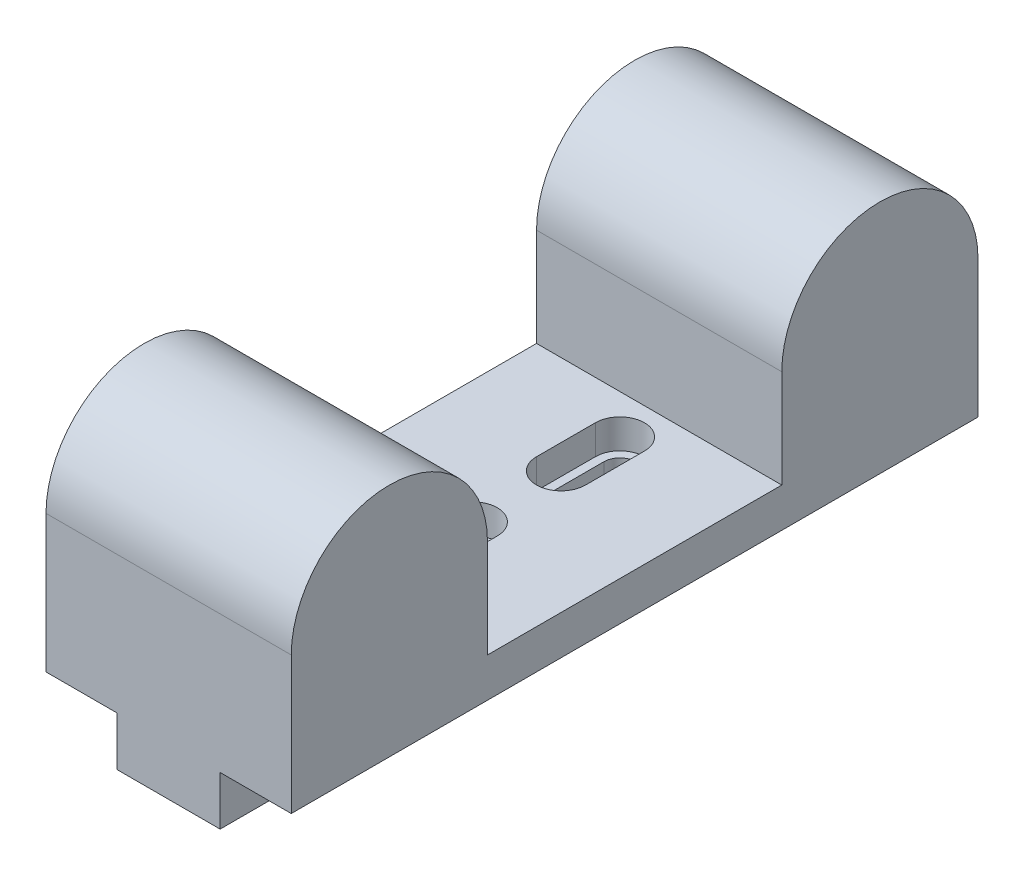
ISO-10303-21;
HEADER;
FILE_DESCRIPTION(('STEP AP214'),'2;1');
FILE_NAME('part.step','',(''),(''),'','','');
FILE_SCHEMA(('AUTOMOTIVE_DESIGN { 1 0 10303 214 1 1 1 1 }'));
ENDSEC;
DATA;
#1=APPLICATION_CONTEXT('core data for automotive mechanical design processes');
#2=APPLICATION_PROTOCOL_DEFINITION('international standard','automotive_design',2000,#1);
#3=PRODUCT_CONTEXT('',#1,'mechanical');
#4=PRODUCT('Part','Part','',(#3));
#5=PRODUCT_RELATED_PRODUCT_CATEGORY('part','',(#4));
#6=PRODUCT_DEFINITION_FORMATION('','',#4);
#7=PRODUCT_DEFINITION_CONTEXT('part definition',#1,'design');
#8=PRODUCT_DEFINITION('design','',#6,#7);
#9=PRODUCT_DEFINITION_SHAPE('','',#8);
#10=(LENGTH_UNIT() NAMED_UNIT(*) SI_UNIT(.MILLI.,.METRE.));
#11=(NAMED_UNIT(*) PLANE_ANGLE_UNIT() SI_UNIT($,.RADIAN.));
#12=(NAMED_UNIT(*) SI_UNIT($,.STERADIAN.) SOLID_ANGLE_UNIT());
#13=UNCERTAINTY_MEASURE_WITH_UNIT(LENGTH_MEASURE(1.E-05),#10,'distance_accuracy_value','');
#14=(GEOMETRIC_REPRESENTATION_CONTEXT(3) GLOBAL_UNCERTAINTY_ASSIGNED_CONTEXT((#13)) GLOBAL_UNIT_ASSIGNED_CONTEXT((#10,
#11,#12)) REPRESENTATION_CONTEXT('',''));
#15=CARTESIAN_POINT('',(0.,0.,0.));
#16=DIRECTION('',(0.,0.,1.));
#17=DIRECTION('',(1.,0.,0.));
#18=AXIS2_PLACEMENT_3D('',#15,#16,#17);
#19=CARTESIAN_POINT('',(0.,-5.,-46.));
#20=DIRECTION('',(0.,1.,0.));
#21=DIRECTION('',(0.,0.,1.));
#22=AXIS2_PLACEMENT_3D('',#19,#20,#21);
#23=CYLINDRICAL_SURFACE('',#22,1.625);
#24=CARTESIAN_POINT('',(0.,1.,-46.));
#25=DIRECTION('',(0.,1.,0.));
#26=DIRECTION('',(0.,0.,1.));
#27=AXIS2_PLACEMENT_3D('',#24,#25,#26);
#28=CIRCLE('',#27,1.625);
#29=CARTESIAN_POINT('',(1.625,1.,-46.));
#30=VERTEX_POINT('',#29);
#31=CARTESIAN_POINT('',(-1.62500000000001,1.,-46.));
#32=VERTEX_POINT('',#31);
#33=EDGE_CURVE('E598',#30,#32,#28,.T.);
#34=ORIENTED_EDGE('',*,*,#33,.T.);
#35=DIRECTION('',(0.,1.,0.));
#36=VECTOR('',#35,1.);
#37=CARTESIAN_POINT('',(-1.625,-5.,-46.));
#38=LINE('',#37,#36);
#39=CARTESIAN_POINT('',(-1.62500000000001,-5.,-46.));
#40=VERTEX_POINT('',#39);
#41=EDGE_CURVE('E354',#40,#32,#38,.T.);
#42=ORIENTED_EDGE('',*,*,#41,.F.);
#43=CARTESIAN_POINT('',(0.,-5.,-46.));
#44=DIRECTION('',(0.,1.,0.));
#45=DIRECTION('',(0.,0.,1.));
#46=AXIS2_PLACEMENT_3D('',#43,#44,#45);
#47=CIRCLE('',#46,1.625);
#48=CARTESIAN_POINT('',(-1.41046082365937,-5.,-46.8069852941177));
#49=VERTEX_POINT('',#48);
#50=EDGE_CURVE('E12',#49,#40,#47,.T.);
#51=ORIENTED_EDGE('',*,*,#50,.F.);
#52=DIRECTION('',(0.,1.,0.));
#53=VECTOR('',#52,1.);
#54=CARTESIAN_POINT('',(-1.41046082365937,-2.5,-46.8069852941177));
#55=LINE('',#54,#53);
#56=CARTESIAN_POINT('',(-1.41046082365937,0.,-46.8069852941177));
#57=VERTEX_POINT('',#56);
#58=EDGE_CURVE('E369',#57,#49,#55,.F.);
#59=ORIENTED_EDGE('',*,*,#58,.F.);
#60=CARTESIAN_POINT('',(0.,0.,-46.));
#61=DIRECTION('',(0.,1.,0.));
#62=DIRECTION('',(0.,0.,1.));
#63=AXIS2_PLACEMENT_3D('',#60,#61,#62);
#64=CIRCLE('',#63,1.625);
#65=CARTESIAN_POINT('',(1.41046082365936,0.,-46.8069852941177));
#66=VERTEX_POINT('',#65);
#67=EDGE_CURVE('E365',#66,#57,#64,.T.);
#68=ORIENTED_EDGE('',*,*,#67,.F.);
#69=DIRECTION('',(0.,1.,0.));
#70=VECTOR('',#69,1.);
#71=CARTESIAN_POINT('',(1.41046082365936,-2.5,-46.8069852941177));
#72=LINE('',#71,#70);
#73=CARTESIAN_POINT('',(1.41046082365936,-5.,-46.8069852941177));
#74=VERTEX_POINT('',#73);
#75=EDGE_CURVE('E361',#74,#66,#72,.T.);
#76=ORIENTED_EDGE('',*,*,#75,.F.);
#77=CARTESIAN_POINT('',(0.,-5.,-46.));
#78=DIRECTION('',(0.,1.,0.));
#79=DIRECTION('',(0.,0.,1.));
#80=AXIS2_PLACEMENT_3D('',#77,#78,#79);
#81=CIRCLE('',#80,1.625);
#82=CARTESIAN_POINT('',(1.625,-5.,-46.));
#83=VERTEX_POINT('',#82);
#84=EDGE_CURVE('E331',#83,#74,#81,.T.);
#85=ORIENTED_EDGE('',*,*,#84,.F.);
#86=DIRECTION('',(0.,1.,0.));
#87=VECTOR('',#86,1.);
#88=CARTESIAN_POINT('',(1.625,-5.,-46.));
#89=LINE('',#88,#87);
#90=EDGE_CURVE('E344',#83,#30,#89,.T.);
#91=ORIENTED_EDGE('',*,*,#90,.T.);
#92=EDGE_LOOP('',(#34,#42,#51,#59,#68,#76,#85,#91));
#93=FACE_BOUND('',#92,.T.);
#94=ADVANCED_FACE('F89',(#93),#23,.F.);
#95=CARTESIAN_POINT('',(1.62500000000001,-5.,0.));
#96=DIRECTION('',(-1.,0.,0.));
#97=DIRECTION('',(0.,0.,1.));
#98=AXIS2_PLACEMENT_3D('',#95,#96,#97);
#99=PLANE('',#98);
#100=DIRECTION('',(0.,1.,0.));
#101=VECTOR('',#100,1.);
#102=CARTESIAN_POINT('',(1.625,-5.,-40.));
#103=LINE('',#102,#101);
#104=CARTESIAN_POINT('',(1.625,-5.,-40.));
#105=VERTEX_POINT('',#104);
#106=CARTESIAN_POINT('',(1.625,1.,-40.));
#107=VERTEX_POINT('',#106);
#108=EDGE_CURVE('E345',#105,#107,#103,.T.);
#109=ORIENTED_EDGE('',*,*,#108,.T.);
#110=DIRECTION('',(0.,0.,-1.));
#111=VECTOR('',#110,1.);
#112=CARTESIAN_POINT('',(1.62500000000001,1.,0.));
#113=LINE('',#112,#111);
#114=EDGE_CURVE('E594',#107,#30,#113,.T.);
#115=ORIENTED_EDGE('',*,*,#114,.T.);
#116=ORIENTED_EDGE('',*,*,#90,.F.);
#117=DIRECTION('',(0.,0.,1.));
#118=VECTOR('',#117,1.);
#119=CARTESIAN_POINT('',(1.62500000000001,-5.,0.));
#120=LINE('',#119,#118);
#121=EDGE_CURVE('E328',#83,#105,#120,.T.);
#122=ORIENTED_EDGE('',*,*,#121,.T.);
#123=EDGE_LOOP('',(#109,#115,#116,#122));
#124=FACE_BOUND('',#123,.T.);
#125=ADVANCED_FACE('F669',(#124),#99,.T.);
#126=CARTESIAN_POINT('',(0.,-5.,-40.));
#127=DIRECTION('',(0.,1.,0.));
#128=DIRECTION('',(0.,0.,1.));
#129=AXIS2_PLACEMENT_3D('',#126,#127,#128);
#130=CYLINDRICAL_SURFACE('',#129,1.62500000000001);
#131=CARTESIAN_POINT('',(0.,1.,-40.));
#132=DIRECTION('',(0.,1.,0.));
#133=DIRECTION('',(0.,0.,1.));
#134=AXIS2_PLACEMENT_3D('',#131,#132,#133);
#135=CIRCLE('',#134,1.62500000000001);
#136=CARTESIAN_POINT('',(-1.62500000000001,1.,-40.));
#137=VERTEX_POINT('',#136);
#138=EDGE_CURVE('E577',#137,#107,#135,.T.);
#139=ORIENTED_EDGE('',*,*,#138,.T.);
#140=ORIENTED_EDGE('',*,*,#108,.F.);
#141=CARTESIAN_POINT('',(0.,-5.,-40.));
#142=DIRECTION('',(0.,1.,0.));
#143=DIRECTION('',(0.,0.,1.));
#144=AXIS2_PLACEMENT_3D('',#141,#142,#143);
#145=CIRCLE('',#144,1.62500000000001);
#146=CARTESIAN_POINT('',(-1.62500000000001,-5.,-40.));
#147=VERTEX_POINT('',#146);
#148=EDGE_CURVE('E340',#147,#105,#145,.T.);
#149=ORIENTED_EDGE('',*,*,#148,.F.);
#150=DIRECTION('',(0.,1.,0.));
#151=VECTOR('',#150,1.);
#152=CARTESIAN_POINT('',(-1.62500000000001,-5.,-40.));
#153=LINE('',#152,#151);
#154=EDGE_CURVE('E350',#147,#137,#153,.T.);
#155=ORIENTED_EDGE('',*,*,#154,.T.);
#156=EDGE_LOOP('',(#139,#140,#149,#155));
#157=FACE_BOUND('',#156,.T.);
#158=ADVANCED_FACE('F675',(#157),#130,.F.);
#159=CARTESIAN_POINT('',(-1.62500000000009,-5.,0.));
#160=DIRECTION('',(-1.,0.,0.));
#161=DIRECTION('',(0.,0.,1.));
#162=AXIS2_PLACEMENT_3D('',#159,#160,#161);
#163=PLANE('',#162);
#164=DIRECTION('',(0.,0.,-1.));
#165=VECTOR('',#164,1.);
#166=CARTESIAN_POINT('',(-1.62500000000009,1.,0.));
#167=LINE('',#166,#165);
#168=EDGE_CURVE('E602',#137,#32,#167,.T.);
#169=ORIENTED_EDGE('',*,*,#168,.F.);
#170=ORIENTED_EDGE('',*,*,#154,.F.);
#171=DIRECTION('',(0.,0.,1.));
#172=VECTOR('',#171,1.);
#173=CARTESIAN_POINT('',(-1.62500000000009,-5.,0.));
#174=LINE('',#173,#172);
#175=EDGE_CURVE('E336',#40,#147,#174,.T.);
#176=ORIENTED_EDGE('',*,*,#175,.F.);
#177=ORIENTED_EDGE('',*,*,#41,.T.);
#178=EDGE_LOOP('',(#169,#170,#176,#177));
#179=FACE_BOUND('',#178,.T.);
#180=ADVANCED_FACE('F678',(#179),#163,.F.);
#181=CARTESIAN_POINT('',(1.62500000000001,-5.,0.));
#182=DIRECTION('',(-1.,0.,0.));
#183=DIRECTION('',(0.,0.,1.));
#184=AXIS2_PLACEMENT_3D('',#181,#182,#183);
#185=PLANE('',#184);
#186=DIRECTION('',(0.,1.,0.));
#187=VECTOR('',#186,1.);
#188=CARTESIAN_POINT('',(1.62500000000001,-5.,-25.));
#189=LINE('',#188,#187);
#190=CARTESIAN_POINT('',(1.62500000000001,-5.,-25.));
#191=VERTEX_POINT('',#190);
#192=CARTESIAN_POINT('',(1.62500000000001,1.,-25.));
#193=VERTEX_POINT('',#192);
#194=EDGE_CURVE('E307',#191,#193,#189,.T.);
#195=ORIENTED_EDGE('',*,*,#194,.T.);
#196=DIRECTION('',(0.,0.,-1.));
#197=VECTOR('',#196,1.);
#198=CARTESIAN_POINT('',(1.62500000000001,1.,0.));
#199=LINE('',#198,#197);
#200=CARTESIAN_POINT('',(1.62500000000001,1.,-31.));
#201=VERTEX_POINT('',#200);
#202=EDGE_CURVE('E291',#193,#201,#199,.T.);
#203=ORIENTED_EDGE('',*,*,#202,.T.);
#204=DIRECTION('',(0.,1.,0.));
#205=VECTOR('',#204,1.);
#206=CARTESIAN_POINT('',(1.62500000000001,-5.,-31.));
#207=LINE('',#206,#205);
#208=CARTESIAN_POINT('',(1.62500000000001,-5.,-31.));
#209=VERTEX_POINT('',#208);
#210=EDGE_CURVE('E304',#209,#201,#207,.T.);
#211=ORIENTED_EDGE('',*,*,#210,.F.);
#212=DIRECTION('',(0.,0.,1.));
#213=VECTOR('',#212,1.);
#214=CARTESIAN_POINT('',(1.62500000000001,-5.,0.));
#215=LINE('',#214,#213);
#216=EDGE_CURVE('E349',#209,#191,#215,.T.);
#217=ORIENTED_EDGE('',*,*,#216,.T.);
#218=EDGE_LOOP('',(#195,#203,#211,#217));
#219=FACE_BOUND('',#218,.T.);
#220=ADVANCED_FACE('F303',(#219),#185,.T.);
#221=CARTESIAN_POINT('',(0.,-5.,-25.));
#222=DIRECTION('',(0.,1.,0.));
#223=DIRECTION('',(0.,0.,1.));
#224=AXIS2_PLACEMENT_3D('',#221,#222,#223);
#225=CYLINDRICAL_SURFACE('',#224,1.62500000000001);
#226=CARTESIAN_POINT('',(0.,1.,-25.));
#227=DIRECTION('',(0.,1.,0.));
#228=DIRECTION('',(0.,0.,1.));
#229=AXIS2_PLACEMENT_3D('',#226,#227,#228);
#230=CIRCLE('',#229,1.62500000000001);
#231=CARTESIAN_POINT('',(-1.625,1.,-25.));
#232=VERTEX_POINT('',#231);
#233=EDGE_CURVE('E309',#232,#193,#230,.T.);
#234=ORIENTED_EDGE('',*,*,#233,.T.);
#235=ORIENTED_EDGE('',*,*,#194,.F.);
#236=CARTESIAN_POINT('',(0.,-5.,-25.));
#237=DIRECTION('',(0.,1.,0.));
#238=DIRECTION('',(0.,0.,1.));
#239=AXIS2_PLACEMENT_3D('',#236,#237,#238);
#240=CIRCLE('',#239,1.62500000000001);
#241=CARTESIAN_POINT('',(-1.625,-5.,-25.));
#242=VERTEX_POINT('',#241);
#243=EDGE_CURVE('E317',#242,#191,#240,.T.);
#244=ORIENTED_EDGE('',*,*,#243,.F.);
#245=DIRECTION('',(0.,1.,0.));
#246=VECTOR('',#245,1.);
#247=CARTESIAN_POINT('',(-1.625,-5.,-25.));
#248=LINE('',#247,#246);
#249=EDGE_CURVE('E321',#242,#232,#248,.T.);
#250=ORIENTED_EDGE('',*,*,#249,.T.);
#251=EDGE_LOOP('',(#234,#235,#244,#250));
#252=FACE_BOUND('',#251,.T.);
#253=ADVANCED_FACE('F648',(#252),#225,.F.);
#254=CARTESIAN_POINT('',(-1.625,-5.,0.));
#255=DIRECTION('',(-1.,0.,0.));
#256=DIRECTION('',(0.,0.,1.));
#257=AXIS2_PLACEMENT_3D('',#254,#255,#256);
#258=PLANE('',#257);
#259=DIRECTION('',(0.,0.,-1.));
#260=VECTOR('',#259,1.);
#261=CARTESIAN_POINT('',(-1.625,1.,0.));
#262=LINE('',#261,#260);
#263=CARTESIAN_POINT('',(-1.625,1.,-31.));
#264=VERTEX_POINT('',#263);
#265=EDGE_CURVE('E294',#232,#264,#262,.T.);
#266=ORIENTED_EDGE('',*,*,#265,.F.);
#267=ORIENTED_EDGE('',*,*,#249,.F.);
#268=DIRECTION('',(0.,0.,1.));
#269=VECTOR('',#268,1.);
#270=CARTESIAN_POINT('',(-1.625,-5.,0.));
#271=LINE('',#270,#269);
#272=CARTESIAN_POINT('',(-1.62500000000001,-5.,-31.));
#273=VERTEX_POINT('',#272);
#274=EDGE_CURVE('E324',#273,#242,#271,.T.);
#275=ORIENTED_EDGE('',*,*,#274,.F.);
#276=DIRECTION('',(0.,1.,0.));
#277=VECTOR('',#276,1.);
#278=CARTESIAN_POINT('',(-1.625,-5.,-31.));
#279=LINE('',#278,#277);
#280=EDGE_CURVE('E316',#273,#264,#279,.T.);
#281=ORIENTED_EDGE('',*,*,#280,.T.);
#282=EDGE_LOOP('',(#266,#267,#275,#281));
#283=FACE_BOUND('',#282,.T.);
#284=ADVANCED_FACE('F650',(#283),#258,.F.);
#285=CARTESIAN_POINT('',(0.,-5.,-31.));
#286=DIRECTION('',(0.,1.,0.));
#287=DIRECTION('',(0.,0.,1.));
#288=AXIS2_PLACEMENT_3D('',#285,#286,#287);
#289=CYLINDRICAL_SURFACE('',#288,1.62500000000001);
#290=CARTESIAN_POINT('',(0.,1.,-31.));
#291=DIRECTION('',(0.,1.,0.));
#292=DIRECTION('',(0.,0.,1.));
#293=AXIS2_PLACEMENT_3D('',#290,#291,#292);
#294=CIRCLE('',#293,1.62500000000001);
#295=EDGE_CURVE('E288',#201,#264,#294,.T.);
#296=ORIENTED_EDGE('',*,*,#295,.T.);
#297=ORIENTED_EDGE('',*,*,#280,.F.);
#298=CARTESIAN_POINT('',(0.,-5.,-31.));
#299=DIRECTION('',(0.,1.,0.));
#300=DIRECTION('',(0.,0.,1.));
#301=AXIS2_PLACEMENT_3D('',#298,#299,#300);
#302=CIRCLE('',#301,1.62500000000001);
#303=EDGE_CURVE('E313',#209,#273,#302,.T.);
#304=ORIENTED_EDGE('',*,*,#303,.F.);
#305=ORIENTED_EDGE('',*,*,#210,.T.);
#306=EDGE_LOOP('',(#296,#297,#304,#305));
#307=FACE_BOUND('',#306,.T.);
#308=ADVANCED_FACE('F311',(#307),#289,.F.);
#309=CARTESIAN_POINT('',(12.5,4.,0.));
#310=DIRECTION('',(0.,1.,0.));
#311=DIRECTION('',(0.,0.,1.));
#312=AXIS2_PLACEMENT_3D('',#309,#310,#311);
#313=PLANE('',#312);
#314=CARTESIAN_POINT('',(0.,4.,-31.));
#315=DIRECTION('',(0.,1.,0.));
#316=DIRECTION('',(0.,0.,1.));
#317=AXIS2_PLACEMENT_3D('',#314,#315,#316);
#318=CIRCLE('',#317,2.50000000000001);
#319=CARTESIAN_POINT('',(2.50000000000001,4.,-31.));
#320=VERTEX_POINT('',#319);
#321=CARTESIAN_POINT('',(-2.50000000000001,4.,-31.));
#322=VERTEX_POINT('',#321);
#323=EDGE_CURVE('E105',#320,#322,#318,.T.);
#324=ORIENTED_EDGE('',*,*,#323,.F.);
#325=DIRECTION('',(0.,0.,-1.));
#326=VECTOR('',#325,1.);
#327=CARTESIAN_POINT('',(2.50000000000001,4.,0.));
#328=LINE('',#327,#326);
#329=CARTESIAN_POINT('',(2.50000000000001,4.,-25.));
#330=VERTEX_POINT('',#329);
#331=EDGE_CURVE('E617',#330,#320,#328,.T.);
#332=ORIENTED_EDGE('',*,*,#331,.F.);
#333=CARTESIAN_POINT('',(0.,4.,-25.));
#334=DIRECTION('',(0.,1.,0.));
#335=DIRECTION('',(0.,0.,1.));
#336=AXIS2_PLACEMENT_3D('',#333,#334,#335);
#337=CIRCLE('',#336,2.50000000000001);
#338=CARTESIAN_POINT('',(-2.5,4.,-25.));
#339=VERTEX_POINT('',#338);
#340=EDGE_CURVE('E622',#339,#330,#337,.T.);
#341=ORIENTED_EDGE('',*,*,#340,.F.);
#342=DIRECTION('',(0.,0.,-1.));
#343=VECTOR('',#342,1.);
#344=CARTESIAN_POINT('',(-2.5,4.,0.));
#345=LINE('',#344,#343);
#346=EDGE_CURVE('E626',#339,#322,#345,.T.);
#347=ORIENTED_EDGE('',*,*,#346,.T.);
#348=EDGE_LOOP('',(#324,#332,#341,#347));
#349=FACE_BOUND('',#348,.T.);
#350=CARTESIAN_POINT('',(0.,4.,-46.));
#351=DIRECTION('',(0.,1.,0.));
#352=DIRECTION('',(0.,0.,1.));
#353=AXIS2_PLACEMENT_3D('',#350,#351,#352);
#354=CIRCLE('',#353,2.5);
#355=CARTESIAN_POINT('',(2.5,4.,-46.));
#356=VERTEX_POINT('',#355);
#357=CARTESIAN_POINT('',(-2.5,4.,-46.));
#358=VERTEX_POINT('',#357);
#359=EDGE_CURVE('E113',#356,#358,#354,.T.);
#360=ORIENTED_EDGE('',*,*,#359,.F.);
#361=DIRECTION('',(0.,0.,-1.));
#362=VECTOR('',#361,1.);
#363=CARTESIAN_POINT('',(2.5,4.,0.));
#364=LINE('',#363,#362);
#365=CARTESIAN_POINT('',(2.5,4.,-40.));
#366=VERTEX_POINT('',#365);
#367=EDGE_CURVE('E562',#366,#356,#364,.T.);
#368=ORIENTED_EDGE('',*,*,#367,.F.);
#369=CARTESIAN_POINT('',(0.,4.,-40.));
#370=DIRECTION('',(0.,1.,0.));
#371=DIRECTION('',(0.,0.,1.));
#372=AXIS2_PLACEMENT_3D('',#369,#370,#371);
#373=CIRCLE('',#372,2.5);
#374=CARTESIAN_POINT('',(-2.5,4.,-40.));
#375=VERTEX_POINT('',#374);
#376=EDGE_CURVE('E567',#375,#366,#373,.T.);
#377=ORIENTED_EDGE('',*,*,#376,.F.);
#378=DIRECTION('',(0.,0.,-1.));
#379=VECTOR('',#378,1.);
#380=CARTESIAN_POINT('',(-2.5,4.,0.));
#381=LINE('',#380,#379);
#382=EDGE_CURVE('E571',#375,#358,#381,.T.);
#383=ORIENTED_EDGE('',*,*,#382,.T.);
#384=EDGE_LOOP('',(#360,#368,#377,#383));
#385=FACE_BOUND('',#384,.T.);
#386=DIRECTION('',(0.,0.,-1.));
#387=VECTOR('',#386,1.);
#388=CARTESIAN_POINT('',(-12.5,4.,0.));
#389=LINE('',#388,#387);
#390=CARTESIAN_POINT('',(-12.5,4.,-20.));
#391=VERTEX_POINT('',#390);
#392=CARTESIAN_POINT('',(-12.5,4.,-50.));
#393=VERTEX_POINT('',#392);
#394=EDGE_CURVE('E469',#391,#393,#389,.T.);
#395=ORIENTED_EDGE('',*,*,#394,.F.);
#396=DIRECTION('',(-1.,0.,0.));
#397=VECTOR('',#396,1.);
#398=CARTESIAN_POINT('',(12.5,4.,-20.));
#399=LINE('',#398,#397);
#400=CARTESIAN_POINT('',(12.5,4.,-20.));
#401=VERTEX_POINT('',#400);
#402=EDGE_CURVE('E478',#401,#391,#399,.T.);
#403=ORIENTED_EDGE('',*,*,#402,.F.);
#404=DIRECTION('',(0.,0.,-1.));
#405=VECTOR('',#404,1.);
#406=CARTESIAN_POINT('',(12.5,4.,0.));
#407=LINE('',#406,#405);
#408=CARTESIAN_POINT('',(12.5,4.,-50.));
#409=VERTEX_POINT('',#408);
#410=EDGE_CURVE('E438',#401,#409,#407,.T.);
#411=ORIENTED_EDGE('',*,*,#410,.T.);
#412=DIRECTION('',(-1.,0.,0.));
#413=VECTOR('',#412,1.);
#414=CARTESIAN_POINT('',(12.5,4.,-50.));
#415=LINE('',#414,#413);
#416=EDGE_CURVE('E481',#409,#393,#415,.T.);
#417=ORIENTED_EDGE('',*,*,#416,.T.);
#418=EDGE_LOOP('',(#395,#403,#411,#417));
#419=FACE_BOUND('',#418,.T.);
#420=ADVANCED_FACE('F662',(#349,#385,#419),#313,.T.);
#421=CARTESIAN_POINT('',(0.,-5.,-41.75));
#422=DIRECTION('',(0.,1.,0.));
#423=DIRECTION('',(0.,0.,1.));
#424=AXIS2_PLACEMENT_3D('',#421,#422,#423);
#425=CYLINDRICAL_SURFACE('',#424,5.25000000000001);
#426=CARTESIAN_POINT('',(0.,0.,-41.75));
#427=DIRECTION('',(0.,1.,0.));
#428=DIRECTION('',(0.,0.,1.));
#429=AXIS2_PLACEMENT_3D('',#426,#427,#428);
#430=CIRCLE('',#429,5.25000000000001);
#431=CARTESIAN_POINT('',(-5.25000000000002,0.,-41.75));
#432=VERTEX_POINT('',#431);
#433=EDGE_CURVE('E391',#432,#57,#430,.F.);
#434=ORIENTED_EDGE('',*,*,#433,.T.);
#435=ORIENTED_EDGE('',*,*,#58,.T.);
#436=CARTESIAN_POINT('',(0.,-5.,-41.75));
#437=DIRECTION('',(0.,1.,0.));
#438=DIRECTION('',(0.,0.,1.));
#439=AXIS2_PLACEMENT_3D('',#436,#437,#438);
#440=CIRCLE('',#439,5.25000000000001);
#441=CARTESIAN_POINT('',(-5.25000000000002,-5.,-41.75));
#442=VERTEX_POINT('',#441);
#443=EDGE_CURVE('E374',#442,#49,#440,.F.);
#444=ORIENTED_EDGE('',*,*,#443,.F.);
#445=DIRECTION('',(0.,1.,0.));
#446=VECTOR('',#445,1.);
#447=CARTESIAN_POINT('',(-5.25000000000002,-5.,-41.75));
#448=LINE('',#447,#446);
#449=EDGE_CURVE('E390',#442,#432,#448,.T.);
#450=ORIENTED_EDGE('',*,*,#449,.T.);
#451=EDGE_LOOP('',(#434,#435,#444,#450));
#452=FACE_BOUND('',#451,.T.);
#453=ADVANCED_FACE('F654',(#452),#425,.T.);
#454=CARTESIAN_POINT('',(0.,-5.,0.));
#455=DIRECTION('',(0.,1.,0.));
#456=DIRECTION('',(0.,0.,1.));
#457=AXIS2_PLACEMENT_3D('',#454,#455,#456);
#458=PLANE('',#457);
#459=ORIENTED_EDGE('',*,*,#121,.F.);
#460=ORIENTED_EDGE('',*,*,#84,.T.);
#461=CARTESIAN_POINT('',(5.25,-5.,-41.75));
#462=VERTEX_POINT('',#461);
#463=EDGE_CURVE('E379',#74,#462,#440,.F.);
#464=ORIENTED_EDGE('',*,*,#463,.T.);
#465=DIRECTION('',(0.,0.,-1.));
#466=VECTOR('',#465,1.);
#467=CARTESIAN_POINT('',(5.25,-5.,0.));
#468=LINE('',#467,#466);
#469=CARTESIAN_POINT('',(5.25,-5.,0.));
#470=VERTEX_POINT('',#469);
#471=EDGE_CURVE('E386',#470,#462,#468,.T.);
#472=ORIENTED_EDGE('',*,*,#471,.F.);
#473=DIRECTION('',(1.,0.,0.));
#474=VECTOR('',#473,1.);
#475=CARTESIAN_POINT('',(0.,-5.,0.));
#476=LINE('',#475,#474);
#477=CARTESIAN_POINT('',(-5.25,-5.,0.));
#478=VERTEX_POINT('',#477);
#479=EDGE_CURVE('E382',#478,#470,#476,.T.);
#480=ORIENTED_EDGE('',*,*,#479,.F.);
#481=DIRECTION('',(0.,0.,-1.));
#482=VECTOR('',#481,1.);
#483=CARTESIAN_POINT('',(-5.25,-5.,0.));
#484=LINE('',#483,#482);
#485=EDGE_CURVE('E378',#478,#442,#484,.T.);
#486=ORIENTED_EDGE('',*,*,#485,.T.);
#487=ORIENTED_EDGE('',*,*,#443,.T.);
#488=ORIENTED_EDGE('',*,*,#50,.T.);
#489=ORIENTED_EDGE('',*,*,#175,.T.);
#490=ORIENTED_EDGE('',*,*,#148,.T.);
#491=EDGE_LOOP('',(#459,#460,#464,#472,#480,#486,#487,#488,#489,#490));
#492=FACE_BOUND('',#491,.T.);
#493=ORIENTED_EDGE('',*,*,#216,.F.);
#494=ORIENTED_EDGE('',*,*,#303,.T.);
#495=ORIENTED_EDGE('',*,*,#274,.T.);
#496=ORIENTED_EDGE('',*,*,#243,.T.);
#497=EDGE_LOOP('',(#493,#494,#495,#496));
#498=FACE_BOUND('',#497,.T.);
#499=ADVANCED_FACE('F652',(#492,#498),#458,.F.);
#500=CARTESIAN_POINT('',(12.5,0.,0.));
#501=DIRECTION('',(0.,1.,0.));
#502=DIRECTION('',(0.,0.,1.));
#503=AXIS2_PLACEMENT_3D('',#500,#501,#502);
#504=PLANE('',#503);
#505=CARTESIAN_POINT('',(5.25,0.,-41.75));
#506=VERTEX_POINT('',#505);
#507=EDGE_CURVE('E373',#66,#506,#430,.F.);
#508=ORIENTED_EDGE('',*,*,#507,.F.);
#509=ORIENTED_EDGE('',*,*,#67,.T.);
#510=ORIENTED_EDGE('',*,*,#433,.F.);
#511=DIRECTION('',(0.,0.,-1.));
#512=VECTOR('',#511,1.);
#513=CARTESIAN_POINT('',(-5.25,0.,0.));
#514=LINE('',#513,#512);
#515=CARTESIAN_POINT('',(-5.25,0.,0.));
#516=VERTEX_POINT('',#515);
#517=EDGE_CURVE('E395',#516,#432,#514,.T.);
#518=ORIENTED_EDGE('',*,*,#517,.F.);
#519=DIRECTION('',(-1.,0.,0.));
#520=VECTOR('',#519,1.);
#521=CARTESIAN_POINT('',(12.5,0.,0.));
#522=LINE('',#521,#520);
#523=CARTESIAN_POINT('',(-12.5,0.,0.));
#524=VERTEX_POINT('',#523);
#525=EDGE_CURVE('E494',#516,#524,#522,.T.);
#526=ORIENTED_EDGE('',*,*,#525,.T.);
#527=DIRECTION('',(0.,0.,-1.));
#528=VECTOR('',#527,1.);
#529=CARTESIAN_POINT('',(-12.5,0.,0.));
#530=LINE('',#529,#528);
#531=CARTESIAN_POINT('',(-12.5,0.,-70.));
#532=VERTEX_POINT('',#531);
#533=EDGE_CURVE('E454',#524,#532,#530,.T.);
#534=ORIENTED_EDGE('',*,*,#533,.T.);
#535=DIRECTION('',(-1.,0.,0.));
#536=VECTOR('',#535,1.);
#537=CARTESIAN_POINT('',(12.5,0.,-70.));
#538=LINE('',#537,#536);
#539=CARTESIAN_POINT('',(12.5,0.,-70.));
#540=VERTEX_POINT('',#539);
#541=EDGE_CURVE('E490',#540,#532,#538,.T.);
#542=ORIENTED_EDGE('',*,*,#541,.F.);
#543=DIRECTION('',(0.,0.,-1.));
#544=VECTOR('',#543,1.);
#545=CARTESIAN_POINT('',(12.5,0.,0.));
#546=LINE('',#545,#544);
#547=CARTESIAN_POINT('',(12.5,0.,0.));
#548=VERTEX_POINT('',#547);
#549=EDGE_CURVE('E425',#548,#540,#546,.T.);
#550=ORIENTED_EDGE('',*,*,#549,.F.);
#551=CARTESIAN_POINT('',(5.25,0.,0.));
#552=VERTEX_POINT('',#551);
#553=EDGE_CURVE('E495',#548,#552,#522,.T.);
#554=ORIENTED_EDGE('',*,*,#553,.T.);
#555=DIRECTION('',(0.,0.,-1.));
#556=VECTOR('',#555,1.);
#557=CARTESIAN_POINT('',(5.25,0.,0.));
#558=LINE('',#557,#556);
#559=EDGE_CURVE('E398',#552,#506,#558,.T.);
#560=ORIENTED_EDGE('',*,*,#559,.T.);
#561=EDGE_LOOP('',(#508,#509,#510,#518,#526,#534,#542,#550,#554,#560));
#562=FACE_BOUND('',#561,.T.);
#563=ADVANCED_FACE('F515',(#562),#504,.F.);
#564=CARTESIAN_POINT('',(12.5,14.,-10.));
#565=DIRECTION('',(-1.,0.,0.));
#566=DIRECTION('',(0.,0.,1.));
#567=AXIS2_PLACEMENT_3D('',#564,#565,#566);
#568=CYLINDRICAL_SURFACE('',#567,10.);
#569=CARTESIAN_POINT('',(-12.5,14.,-10.));
#570=DIRECTION('',(1.,0.,0.));
#571=DIRECTION('',(0.,0.,-1.));
#572=AXIS2_PLACEMENT_3D('',#569,#570,#571);
#573=CIRCLE('',#572,10.);
#574=CARTESIAN_POINT('',(-12.5,14.,0.));
#575=VERTEX_POINT('',#574);
#576=CARTESIAN_POINT('',(-12.5,14.,-20.));
#577=VERTEX_POINT('',#576);
#578=EDGE_CURVE('E406',#575,#577,#573,.F.);
#579=ORIENTED_EDGE('',*,*,#578,.F.);
#580=DIRECTION('',(-1.,0.,0.));
#581=VECTOR('',#580,1.);
#582=CARTESIAN_POINT('',(12.5,14.,0.));
#583=LINE('',#582,#581);
#584=CARTESIAN_POINT('',(12.5,14.,0.));
#585=VERTEX_POINT('',#584);
#586=EDGE_CURVE('E98',#585,#575,#583,.T.);
#587=ORIENTED_EDGE('',*,*,#586,.F.);
#588=CARTESIAN_POINT('',(12.5,14.,-10.));
#589=DIRECTION('',(1.,0.,0.));
#590=DIRECTION('',(0.,0.,-1.));
#591=AXIS2_PLACEMENT_3D('',#588,#589,#590);
#592=CIRCLE('',#591,10.);
#593=CARTESIAN_POINT('',(12.5,14.,-20.));
#594=VERTEX_POINT('',#593);
#595=EDGE_CURVE('E416',#585,#594,#592,.F.);
#596=ORIENTED_EDGE('',*,*,#595,.T.);
#597=DIRECTION('',(-1.,0.,0.));
#598=VECTOR('',#597,1.);
#599=CARTESIAN_POINT('',(12.5,14.,-20.));
#600=LINE('',#599,#598);
#601=EDGE_CURVE('E446',#594,#577,#600,.T.);
#602=ORIENTED_EDGE('',*,*,#601,.T.);
#603=EDGE_LOOP('',(#579,#587,#596,#602));
#604=FACE_BOUND('',#603,.T.);
#605=ADVANCED_FACE('F91',(#604),#568,.T.);
#606=CARTESIAN_POINT('',(12.5,0.,0.));
#607=DIRECTION('',(0.,0.,1.));
#608=DIRECTION('',(1.,0.,0.));
#609=AXIS2_PLACEMENT_3D('',#606,#607,#608);
#610=PLANE('',#609);
#611=DIRECTION('',(0.,1.,0.));
#612=VECTOR('',#611,1.);
#613=CARTESIAN_POINT('',(-12.5,0.,0.));
#614=LINE('',#613,#612);
#615=EDGE_CURVE('E450',#524,#575,#614,.T.);
#616=ORIENTED_EDGE('',*,*,#615,.F.);
#617=ORIENTED_EDGE('',*,*,#525,.F.);
#618=DIRECTION('',(0.,1.,0.));
#619=VECTOR('',#618,1.);
#620=CARTESIAN_POINT('',(-5.25,-5.,0.));
#621=LINE('',#620,#619);
#622=EDGE_CURVE('E410',#478,#516,#621,.T.);
#623=ORIENTED_EDGE('',*,*,#622,.F.);
#624=ORIENTED_EDGE('',*,*,#479,.T.);
#625=DIRECTION('',(0.,1.,0.));
#626=VECTOR('',#625,1.);
#627=CARTESIAN_POINT('',(5.25,-5.,0.));
#628=LINE('',#627,#626);
#629=EDGE_CURVE('E407',#470,#552,#628,.T.);
#630=ORIENTED_EDGE('',*,*,#629,.T.);
#631=ORIENTED_EDGE('',*,*,#553,.F.);
#632=DIRECTION('',(0.,1.,0.));
#633=VECTOR('',#632,1.);
#634=CARTESIAN_POINT('',(12.5,0.,0.));
#635=LINE('',#634,#633);
#636=EDGE_CURVE('E420',#548,#585,#635,.T.);
#637=ORIENTED_EDGE('',*,*,#636,.T.);
#638=ORIENTED_EDGE('',*,*,#586,.T.);
#639=EDGE_LOOP('',(#616,#617,#623,#624,#630,#631,#637,#638));
#640=FACE_BOUND('',#639,.T.);
#641=ADVANCED_FACE('F502',(#640),#610,.T.);
#642=CARTESIAN_POINT('',(12.5,0.,-70.));
#643=DIRECTION('',(0.,0.,1.));
#644=DIRECTION('',(1.,0.,0.));
#645=AXIS2_PLACEMENT_3D('',#642,#643,#644);
#646=PLANE('',#645);
#647=DIRECTION('',(0.,1.,0.));
#648=VECTOR('',#647,1.);
#649=CARTESIAN_POINT('',(-12.5,0.,-70.));
#650=LINE('',#649,#648);
#651=CARTESIAN_POINT('',(-12.5,14.,-70.));
#652=VERTEX_POINT('',#651);
#653=EDGE_CURVE('E457',#532,#652,#650,.T.);
#654=ORIENTED_EDGE('',*,*,#653,.T.);
#655=DIRECTION('',(-1.,0.,0.));
#656=VECTOR('',#655,1.);
#657=CARTESIAN_POINT('',(12.5,14.,-70.));
#658=LINE('',#657,#656);
#659=CARTESIAN_POINT('',(12.5,14.,-70.));
#660=VERTEX_POINT('',#659);
#661=EDGE_CURVE('E487',#660,#652,#658,.T.);
#662=ORIENTED_EDGE('',*,*,#661,.F.);
#663=DIRECTION('',(0.,1.,0.));
#664=VECTOR('',#663,1.);
#665=CARTESIAN_POINT('',(12.5,0.,-70.));
#666=LINE('',#665,#664);
#667=EDGE_CURVE('E428',#540,#660,#666,.T.);
#668=ORIENTED_EDGE('',*,*,#667,.F.);
#669=ORIENTED_EDGE('',*,*,#541,.T.);
#670=EDGE_LOOP('',(#654,#662,#668,#669));
#671=FACE_BOUND('',#670,.T.);
#672=ADVANCED_FACE('F520',(#671),#646,.F.);
#673=CARTESIAN_POINT('',(12.5,14.,-60.));
#674=DIRECTION('',(-1.,0.,0.));
#675=DIRECTION('',(0.,0.,1.));
#676=AXIS2_PLACEMENT_3D('',#673,#674,#675);
#677=CYLINDRICAL_SURFACE('',#676,10.);
#678=CARTESIAN_POINT('',(-12.5,14.,-60.));
#679=DIRECTION('',(1.,0.,0.));
#680=DIRECTION('',(0.,0.,-1.));
#681=AXIS2_PLACEMENT_3D('',#678,#679,#680);
#682=CIRCLE('',#681,10.);
#683=CARTESIAN_POINT('',(-12.5,14.,-50.));
#684=VERTEX_POINT('',#683);
#685=EDGE_CURVE('E461',#684,#652,#682,.F.);
#686=ORIENTED_EDGE('',*,*,#685,.F.);
#687=DIRECTION('',(-1.,0.,0.));
#688=VECTOR('',#687,1.);
#689=CARTESIAN_POINT('',(12.5,14.,-50.));
#690=LINE('',#689,#688);
#691=CARTESIAN_POINT('',(12.5,14.,-50.));
#692=VERTEX_POINT('',#691);
#693=EDGE_CURVE('E484',#692,#684,#690,.T.);
#694=ORIENTED_EDGE('',*,*,#693,.F.);
#695=CARTESIAN_POINT('',(12.5,14.,-60.));
#696=DIRECTION('',(1.,0.,0.));
#697=DIRECTION('',(0.,0.,-1.));
#698=AXIS2_PLACEMENT_3D('',#695,#696,#697);
#699=CIRCLE('',#698,10.);
#700=EDGE_CURVE('E431',#692,#660,#699,.F.);
#701=ORIENTED_EDGE('',*,*,#700,.T.);
#702=ORIENTED_EDGE('',*,*,#661,.T.);
#703=EDGE_LOOP('',(#686,#694,#701,#702));
#704=FACE_BOUND('',#703,.T.);
#705=ADVANCED_FACE('F760',(#704),#677,.T.);
#706=CARTESIAN_POINT('',(12.5,0.,-50.));
#707=DIRECTION('',(0.,0.,-1.));
#708=DIRECTION('',(-1.,0.,0.));
#709=AXIS2_PLACEMENT_3D('',#706,#707,#708);
#710=PLANE('',#709);
#711=DIRECTION('',(0.,-1.,0.));
#712=VECTOR('',#711,1.);
#713=CARTESIAN_POINT('',(-12.5,0.,-50.));
#714=LINE('',#713,#712);
#715=EDGE_CURVE('E465',#684,#393,#714,.T.);
#716=ORIENTED_EDGE('',*,*,#715,.T.);
#717=ORIENTED_EDGE('',*,*,#416,.F.);
#718=DIRECTION('',(0.,-1.,0.));
#719=VECTOR('',#718,1.);
#720=CARTESIAN_POINT('',(12.5,0.,-50.));
#721=LINE('',#720,#719);
#722=EDGE_CURVE('E435',#692,#409,#721,.T.);
#723=ORIENTED_EDGE('',*,*,#722,.F.);
#724=ORIENTED_EDGE('',*,*,#693,.T.);
#725=EDGE_LOOP('',(#716,#717,#723,#724));
#726=FACE_BOUND('',#725,.T.);
#727=ADVANCED_FACE('F757',(#726),#710,.F.);
#728=CARTESIAN_POINT('',(12.5,0.,-20.));
#729=DIRECTION('',(0.,0.,-1.));
#730=DIRECTION('',(-1.,0.,0.));
#731=AXIS2_PLACEMENT_3D('',#728,#729,#730);
#732=PLANE('',#731);
#733=DIRECTION('',(0.,-1.,0.));
#734=VECTOR('',#733,1.);
#735=CARTESIAN_POINT('',(-12.5,0.,-20.));
#736=LINE('',#735,#734);
#737=EDGE_CURVE('E421',#577,#391,#736,.T.);
#738=ORIENTED_EDGE('',*,*,#737,.F.);
#739=ORIENTED_EDGE('',*,*,#601,.F.);
#740=DIRECTION('',(0.,-1.,0.));
#741=VECTOR('',#740,1.);
#742=CARTESIAN_POINT('',(12.5,0.,-20.));
#743=LINE('',#742,#741);
#744=EDGE_CURVE('E442',#594,#401,#743,.T.);
#745=ORIENTED_EDGE('',*,*,#744,.T.);
#746=ORIENTED_EDGE('',*,*,#402,.T.);
#747=EDGE_LOOP('',(#738,#739,#745,#746));
#748=FACE_BOUND('',#747,.T.);
#749=ADVANCED_FACE('F753',(#748),#732,.T.);
#750=CARTESIAN_POINT('',(12.5,0.,0.));
#751=DIRECTION('',(1.,0.,0.));
#752=DIRECTION('',(0.,0.,-1.));
#753=AXIS2_PLACEMENT_3D('',#750,#751,#752);
#754=PLANE('',#753);
#755=ORIENTED_EDGE('',*,*,#595,.F.);
#756=ORIENTED_EDGE('',*,*,#636,.F.);
#757=ORIENTED_EDGE('',*,*,#549,.T.);
#758=ORIENTED_EDGE('',*,*,#667,.T.);
#759=ORIENTED_EDGE('',*,*,#700,.F.);
#760=ORIENTED_EDGE('',*,*,#722,.T.);
#761=ORIENTED_EDGE('',*,*,#410,.F.);
#762=ORIENTED_EDGE('',*,*,#744,.F.);
#763=EDGE_LOOP('',(#755,#756,#757,#758,#759,#760,#761,#762));
#764=FACE_BOUND('',#763,.T.);
#765=ADVANCED_FACE('F524',(#764),#754,.T.);
#766=CARTESIAN_POINT('',(-12.5,0.,0.));
#767=DIRECTION('',(1.,0.,0.));
#768=DIRECTION('',(0.,0.,-1.));
#769=AXIS2_PLACEMENT_3D('',#766,#767,#768);
#770=PLANE('',#769);
#771=ORIENTED_EDGE('',*,*,#578,.T.);
#772=ORIENTED_EDGE('',*,*,#737,.T.);
#773=ORIENTED_EDGE('',*,*,#394,.T.);
#774=ORIENTED_EDGE('',*,*,#715,.F.);
#775=ORIENTED_EDGE('',*,*,#685,.T.);
#776=ORIENTED_EDGE('',*,*,#653,.F.);
#777=ORIENTED_EDGE('',*,*,#533,.F.);
#778=ORIENTED_EDGE('',*,*,#615,.T.);
#779=EDGE_LOOP('',(#771,#772,#773,#774,#775,#776,#777,#778));
#780=FACE_BOUND('',#779,.T.);
#781=ADVANCED_FACE('F510',(#780),#770,.F.);
#782=ORIENTED_EDGE('',*,*,#463,.F.);
#783=ORIENTED_EDGE('',*,*,#75,.T.);
#784=ORIENTED_EDGE('',*,*,#507,.T.);
#785=DIRECTION('',(0.,1.,0.));
#786=VECTOR('',#785,1.);
#787=CARTESIAN_POINT('',(5.25,-5.,-41.75));
#788=LINE('',#787,#786);
#789=EDGE_CURVE('E402',#462,#506,#788,.T.);
#790=ORIENTED_EDGE('',*,*,#789,.F.);
#791=EDGE_LOOP('',(#782,#783,#784,#790));
#792=FACE_BOUND('',#791,.T.);
#793=ADVANCED_FACE('F533',(#792),#425,.T.);
#794=CARTESIAN_POINT('',(5.25,-5.,0.));
#795=DIRECTION('',(1.,0.,0.));
#796=DIRECTION('',(0.,0.,-1.));
#797=AXIS2_PLACEMENT_3D('',#794,#795,#796);
#798=PLANE('',#797);
#799=ORIENTED_EDGE('',*,*,#559,.F.);
#800=ORIENTED_EDGE('',*,*,#629,.F.);
#801=ORIENTED_EDGE('',*,*,#471,.T.);
#802=ORIENTED_EDGE('',*,*,#789,.T.);
#803=EDGE_LOOP('',(#799,#800,#801,#802));
#804=FACE_BOUND('',#803,.T.);
#805=ADVANCED_FACE('F529',(#804),#798,.T.);
#806=CARTESIAN_POINT('',(-5.25,-5.,0.));
#807=DIRECTION('',(1.,0.,0.));
#808=DIRECTION('',(0.,0.,-1.));
#809=AXIS2_PLACEMENT_3D('',#806,#807,#808);
#810=PLANE('',#809);
#811=ORIENTED_EDGE('',*,*,#517,.T.);
#812=ORIENTED_EDGE('',*,*,#449,.F.);
#813=ORIENTED_EDGE('',*,*,#485,.F.);
#814=ORIENTED_EDGE('',*,*,#622,.T.);
#815=EDGE_LOOP('',(#811,#812,#813,#814));
#816=FACE_BOUND('',#815,.T.);
#817=ADVANCED_FACE('F728',(#816),#810,.F.);
#818=CARTESIAN_POINT('',(0.,1.,-31.));
#819=DIRECTION('',(0.,1.,0.));
#820=DIRECTION('',(0.,0.,1.));
#821=AXIS2_PLACEMENT_3D('',#818,#819,#820);
#822=PLANE('',#821);
#823=CARTESIAN_POINT('',(0.,1.,-31.));
#824=DIRECTION('',(0.,1.,0.));
#825=DIRECTION('',(0.,0.,1.));
#826=AXIS2_PLACEMENT_3D('',#823,#824,#825);
#827=CIRCLE('',#826,2.50000000000001);
#828=CARTESIAN_POINT('',(2.50000000000001,1.,-31.));
#829=VERTEX_POINT('',#828);
#830=CARTESIAN_POINT('',(-2.50000000000001,1.,-31.));
#831=VERTEX_POINT('',#830);
#832=EDGE_CURVE('E621',#829,#831,#827,.T.);
#833=ORIENTED_EDGE('',*,*,#832,.T.);
#834=DIRECTION('',(0.,0.,-1.));
#835=VECTOR('',#834,1.);
#836=CARTESIAN_POINT('',(-2.5,1.,0.));
#837=LINE('',#836,#835);
#838=CARTESIAN_POINT('',(-2.5,1.,-25.));
#839=VERTEX_POINT('',#838);
#840=EDGE_CURVE('E639',#839,#831,#837,.T.);
#841=ORIENTED_EDGE('',*,*,#840,.F.);
#842=CARTESIAN_POINT('',(0.,1.,-25.));
#843=DIRECTION('',(0.,1.,0.));
#844=DIRECTION('',(0.,0.,1.));
#845=AXIS2_PLACEMENT_3D('',#842,#843,#844);
#846=CIRCLE('',#845,2.50000000000001);
#847=CARTESIAN_POINT('',(2.50000000000001,1.,-25.));
#848=VERTEX_POINT('',#847);
#849=EDGE_CURVE('E635',#839,#848,#846,.T.);
#850=ORIENTED_EDGE('',*,*,#849,.T.);
#851=DIRECTION('',(0.,0.,-1.));
#852=VECTOR('',#851,1.);
#853=CARTESIAN_POINT('',(2.50000000000001,1.,0.));
#854=LINE('',#853,#852);
#855=EDGE_CURVE('E609',#848,#829,#854,.T.);
#856=ORIENTED_EDGE('',*,*,#855,.T.);
#857=EDGE_LOOP('',(#833,#841,#850,#856));
#858=FACE_BOUND('',#857,.T.);
#859=ORIENTED_EDGE('',*,*,#265,.T.);
#860=ORIENTED_EDGE('',*,*,#295,.F.);
#861=ORIENTED_EDGE('',*,*,#202,.F.);
#862=ORIENTED_EDGE('',*,*,#233,.F.);
#863=EDGE_LOOP('',(#859,#860,#861,#862));
#864=FACE_BOUND('',#863,.T.);
#865=ADVANCED_FACE('F290',(#858,#864),#822,.T.);
#866=CARTESIAN_POINT('',(0.,1.,-31.));
#867=DIRECTION('',(0.,1.,0.));
#868=DIRECTION('',(0.,0.,1.));
#869=AXIS2_PLACEMENT_3D('',#866,#867,#868);
#870=CYLINDRICAL_SURFACE('',#869,2.50000000000001);
#871=ORIENTED_EDGE('',*,*,#323,.T.);
#872=DIRECTION('',(0.,1.,0.));
#873=VECTOR('',#872,1.);
#874=CARTESIAN_POINT('',(-2.50000000000001,1.,-31.));
#875=LINE('',#874,#873);
#876=EDGE_CURVE('E605',#831,#322,#875,.T.);
#877=ORIENTED_EDGE('',*,*,#876,.F.);
#878=ORIENTED_EDGE('',*,*,#832,.F.);
#879=DIRECTION('',(0.,1.,0.));
#880=VECTOR('',#879,1.);
#881=CARTESIAN_POINT('',(2.50000000000001,1.,-31.));
#882=LINE('',#881,#880);
#883=EDGE_CURVE('E332',#829,#320,#882,.T.);
#884=ORIENTED_EDGE('',*,*,#883,.T.);
#885=EDGE_LOOP('',(#871,#877,#878,#884));
#886=FACE_BOUND('',#885,.T.);
#887=ADVANCED_FACE('F713',(#886),#870,.F.);
#888=CARTESIAN_POINT('',(2.50000000000001,1.,0.));
#889=DIRECTION('',(1.,0.,0.));
#890=DIRECTION('',(0.,0.,-1.));
#891=AXIS2_PLACEMENT_3D('',#888,#889,#890);
#892=PLANE('',#891);
#893=ORIENTED_EDGE('',*,*,#331,.T.);
#894=ORIENTED_EDGE('',*,*,#883,.F.);
#895=ORIENTED_EDGE('',*,*,#855,.F.);
#896=DIRECTION('',(0.,1.,0.));
#897=VECTOR('',#896,1.);
#898=CARTESIAN_POINT('',(2.50000000000001,1.,-25.));
#899=LINE('',#898,#897);
#900=EDGE_CURVE('E612',#848,#330,#899,.T.);
#901=ORIENTED_EDGE('',*,*,#900,.T.);
#902=EDGE_LOOP('',(#893,#894,#895,#901));
#903=FACE_BOUND('',#902,.T.);
#904=ADVANCED_FACE('F716',(#903),#892,.F.);
#905=CARTESIAN_POINT('',(0.,1.,-25.));
#906=DIRECTION('',(0.,1.,0.));
#907=DIRECTION('',(0.,0.,1.));
#908=AXIS2_PLACEMENT_3D('',#905,#906,#907);
#909=CYLINDRICAL_SURFACE('',#908,2.50000000000001);
#910=ORIENTED_EDGE('',*,*,#340,.T.);
#911=ORIENTED_EDGE('',*,*,#900,.F.);
#912=ORIENTED_EDGE('',*,*,#849,.F.);
#913=DIRECTION('',(0.,1.,0.));
#914=VECTOR('',#913,1.);
#915=CARTESIAN_POINT('',(-2.5,1.,-25.));
#916=LINE('',#915,#914);
#917=EDGE_CURVE('E608',#839,#339,#916,.T.);
#918=ORIENTED_EDGE('',*,*,#917,.T.);
#919=EDGE_LOOP('',(#910,#911,#912,#918));
#920=FACE_BOUND('',#919,.T.);
#921=ADVANCED_FACE('F719',(#920),#909,.F.);
#922=CARTESIAN_POINT('',(-2.5,1.,0.));
#923=DIRECTION('',(1.,0.,0.));
#924=DIRECTION('',(0.,0.,-1.));
#925=AXIS2_PLACEMENT_3D('',#922,#923,#924);
#926=PLANE('',#925);
#927=ORIENTED_EDGE('',*,*,#346,.F.);
#928=ORIENTED_EDGE('',*,*,#917,.F.);
#929=ORIENTED_EDGE('',*,*,#840,.T.);
#930=ORIENTED_EDGE('',*,*,#876,.T.);
#931=EDGE_LOOP('',(#927,#928,#929,#930));
#932=FACE_BOUND('',#931,.T.);
#933=ADVANCED_FACE('F711',(#932),#926,.T.);
#934=CARTESIAN_POINT('',(0.,1.,-46.));
#935=DIRECTION('',(0.,1.,0.));
#936=DIRECTION('',(0.,0.,1.));
#937=AXIS2_PLACEMENT_3D('',#934,#935,#936);
#938=PLANE('',#937);
#939=CARTESIAN_POINT('',(0.,1.,-46.));
#940=DIRECTION('',(0.,1.,0.));
#941=DIRECTION('',(0.,0.,1.));
#942=AXIS2_PLACEMENT_3D('',#939,#940,#941);
#943=CIRCLE('',#942,2.5);
#944=CARTESIAN_POINT('',(2.5,1.,-46.));
#945=VERTEX_POINT('',#944);
#946=CARTESIAN_POINT('',(-2.5,1.,-46.));
#947=VERTEX_POINT('',#946);
#948=EDGE_CURVE('E566',#945,#947,#943,.T.);
#949=ORIENTED_EDGE('',*,*,#948,.T.);
#950=DIRECTION('',(0.,0.,-1.));
#951=VECTOR('',#950,1.);
#952=CARTESIAN_POINT('',(-2.5,1.,0.));
#953=LINE('',#952,#951);
#954=CARTESIAN_POINT('',(-2.5,1.,-40.));
#955=VERTEX_POINT('',#954);
#956=EDGE_CURVE('E585',#955,#947,#953,.T.);
#957=ORIENTED_EDGE('',*,*,#956,.F.);
#958=CARTESIAN_POINT('',(0.,1.,-40.));
#959=DIRECTION('',(0.,1.,0.));
#960=DIRECTION('',(0.,0.,1.));
#961=AXIS2_PLACEMENT_3D('',#958,#959,#960);
#962=CIRCLE('',#961,2.5);
#963=CARTESIAN_POINT('',(2.5,1.,-40.));
#964=VERTEX_POINT('',#963);
#965=EDGE_CURVE('E581',#955,#964,#962,.T.);
#966=ORIENTED_EDGE('',*,*,#965,.T.);
#967=DIRECTION('',(0.,0.,-1.));
#968=VECTOR('',#967,1.);
#969=CARTESIAN_POINT('',(2.5,1.,0.));
#970=LINE('',#969,#968);
#971=EDGE_CURVE('E553',#964,#945,#970,.T.);
#972=ORIENTED_EDGE('',*,*,#971,.T.);
#973=EDGE_LOOP('',(#949,#957,#966,#972));
#974=FACE_BOUND('',#973,.T.);
#975=ORIENTED_EDGE('',*,*,#168,.T.);
#976=ORIENTED_EDGE('',*,*,#33,.F.);
#977=ORIENTED_EDGE('',*,*,#114,.F.);
#978=ORIENTED_EDGE('',*,*,#138,.F.);
#979=EDGE_LOOP('',(#975,#976,#977,#978));
#980=FACE_BOUND('',#979,.T.);
#981=ADVANCED_FACE('F697',(#974,#980),#938,.T.);
#982=CARTESIAN_POINT('',(0.,1.,-46.));
#983=DIRECTION('',(0.,1.,0.));
#984=DIRECTION('',(0.,0.,1.));
#985=AXIS2_PLACEMENT_3D('',#982,#983,#984);
#986=CYLINDRICAL_SURFACE('',#985,2.5);
#987=ORIENTED_EDGE('',*,*,#359,.T.);
#988=DIRECTION('',(0.,1.,0.));
#989=VECTOR('',#988,1.);
#990=CARTESIAN_POINT('',(-2.5,1.,-46.));
#991=LINE('',#990,#989);
#992=EDGE_CURVE('E549',#947,#358,#991,.T.);
#993=ORIENTED_EDGE('',*,*,#992,.F.);
#994=ORIENTED_EDGE('',*,*,#948,.F.);
#995=DIRECTION('',(0.,1.,0.));
#996=VECTOR('',#995,1.);
#997=CARTESIAN_POINT('',(2.5,1.,-46.));
#998=LINE('',#997,#996);
#999=EDGE_CURVE('E559',#945,#356,#998,.T.);
#1000=ORIENTED_EDGE('',*,*,#999,.T.);
#1001=EDGE_LOOP('',(#987,#993,#994,#1000));
#1002=FACE_BOUND('',#1001,.T.);
#1003=ADVANCED_FACE('F693',(#1002),#986,.F.);
#1004=CARTESIAN_POINT('',(2.5,1.,0.));
#1005=DIRECTION('',(1.,0.,0.));
#1006=DIRECTION('',(0.,0.,-1.));
#1007=AXIS2_PLACEMENT_3D('',#1004,#1005,#1006);
#1008=PLANE('',#1007);
#1009=ORIENTED_EDGE('',*,*,#367,.T.);
#1010=ORIENTED_EDGE('',*,*,#999,.F.);
#1011=ORIENTED_EDGE('',*,*,#971,.F.);
#1012=DIRECTION('',(0.,1.,0.));
#1013=VECTOR('',#1012,1.);
#1014=CARTESIAN_POINT('',(2.5,1.,-40.));
#1015=LINE('',#1014,#1013);
#1016=EDGE_CURVE('E556',#964,#366,#1015,.T.);
#1017=ORIENTED_EDGE('',*,*,#1016,.T.);
#1018=EDGE_LOOP('',(#1009,#1010,#1011,#1017));
#1019=FACE_BOUND('',#1018,.T.);
#1020=ADVANCED_FACE('F696',(#1019),#1008,.F.);
#1021=CARTESIAN_POINT('',(0.,1.,-40.));
#1022=DIRECTION('',(0.,1.,0.));
#1023=DIRECTION('',(0.,0.,1.));
#1024=AXIS2_PLACEMENT_3D('',#1021,#1022,#1023);
#1025=CYLINDRICAL_SURFACE('',#1024,2.5);
#1026=ORIENTED_EDGE('',*,*,#376,.T.);
#1027=ORIENTED_EDGE('',*,*,#1016,.F.);
#1028=ORIENTED_EDGE('',*,*,#965,.F.);
#1029=DIRECTION('',(0.,1.,0.));
#1030=VECTOR('',#1029,1.);
#1031=CARTESIAN_POINT('',(-2.5,1.,-40.));
#1032=LINE('',#1031,#1030);
#1033=EDGE_CURVE('E552',#955,#375,#1032,.T.);
#1034=ORIENTED_EDGE('',*,*,#1033,.T.);
#1035=EDGE_LOOP('',(#1026,#1027,#1028,#1034));
#1036=FACE_BOUND('',#1035,.T.);
#1037=ADVANCED_FACE('F701',(#1036),#1025,.F.);
#1038=CARTESIAN_POINT('',(-2.5,1.,0.));
#1039=DIRECTION('',(1.,0.,0.));
#1040=DIRECTION('',(0.,0.,-1.));
#1041=AXIS2_PLACEMENT_3D('',#1038,#1039,#1040);
#1042=PLANE('',#1041);
#1043=ORIENTED_EDGE('',*,*,#382,.F.);
#1044=ORIENTED_EDGE('',*,*,#1033,.F.);
#1045=ORIENTED_EDGE('',*,*,#956,.T.);
#1046=ORIENTED_EDGE('',*,*,#992,.T.);
#1047=EDGE_LOOP('',(#1043,#1044,#1045,#1046));
#1048=FACE_BOUND('',#1047,.T.);
#1049=ADVANCED_FACE('F698',(#1048),#1042,.T.);
#1050=CLOSED_SHELL('',(#94,#125,#158,#180,#220,#253,#284,#308,#420,#453,#499,#563,#605,#641,
#672,#705,#727,#749,#765,#781,#793,#805,#817,#865,#887,#904,#921,#933,#981,#1003,#1020,#1037,#1049));
#1051=MANIFOLD_SOLID_BREP('B2',#1050);
#1052=ADVANCED_BREP_SHAPE_REPRESENTATION('',(#18,#1051),#14);
#1053=SHAPE_DEFINITION_REPRESENTATION(#9,#1052);
ENDSEC;
END-ISO-10303-21;
